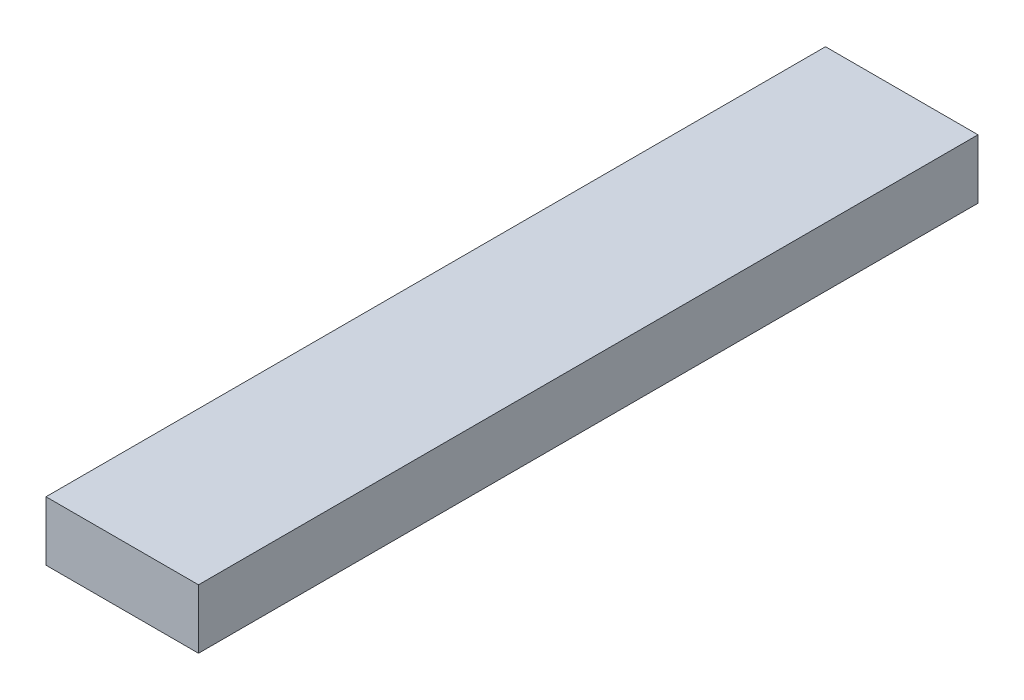
ISO-10303-21;
HEADER;
FILE_DESCRIPTION(('STEP AP214'),'2;1');
FILE_NAME('part.step','',(''),(''),'','','');
FILE_SCHEMA(('AUTOMOTIVE_DESIGN { 1 0 10303 214 1 1 1 1 }'));
ENDSEC;
DATA;
#1=APPLICATION_CONTEXT('core data for automotive mechanical design processes');
#2=APPLICATION_PROTOCOL_DEFINITION('international standard','automotive_design',2000,#1);
#3=PRODUCT_CONTEXT('',#1,'mechanical');
#4=PRODUCT('Part','Part','',(#3));
#5=PRODUCT_RELATED_PRODUCT_CATEGORY('part','',(#4));
#6=PRODUCT_DEFINITION_FORMATION('','',#4);
#7=PRODUCT_DEFINITION_CONTEXT('part definition',#1,'design');
#8=PRODUCT_DEFINITION('design','',#6,#7);
#9=PRODUCT_DEFINITION_SHAPE('','',#8);
#10=(LENGTH_UNIT() NAMED_UNIT(*) SI_UNIT(.MILLI.,.METRE.));
#11=(NAMED_UNIT(*) PLANE_ANGLE_UNIT() SI_UNIT($,.RADIAN.));
#12=(NAMED_UNIT(*) SI_UNIT($,.STERADIAN.) SOLID_ANGLE_UNIT());
#13=UNCERTAINTY_MEASURE_WITH_UNIT(LENGTH_MEASURE(1.E-05),#10,'distance_accuracy_value','');
#14=(GEOMETRIC_REPRESENTATION_CONTEXT(3) GLOBAL_UNCERTAINTY_ASSIGNED_CONTEXT((#13)) GLOBAL_UNIT_ASSIGNED_CONTEXT((#10,
#11,#12)) REPRESENTATION_CONTEXT('',''));
#15=CARTESIAN_POINT('',(0.,0.,0.));
#16=DIRECTION('',(0.,0.,1.));
#17=DIRECTION('',(1.,0.,0.));
#18=AXIS2_PLACEMENT_3D('',#15,#16,#17);
#19=CARTESIAN_POINT('',(-71.5549306416318,5.5177210056772,46.));
#20=DIRECTION('',(1.,0.,0.));
#21=DIRECTION('',(0.,0.,-1.));
#22=AXIS2_PLACEMENT_3D('',#19,#20,#21);
#23=PLANE('',#22);
#24=DIRECTION('',(0.,-1.,0.));
#25=VECTOR('',#24,1.);
#26=CARTESIAN_POINT('',(-71.5549306416318,5.5177210056772,0.));
#27=LINE('',#26,#25);
#28=CARTESIAN_POINT('',(-71.5549306416318,9.0177210056772,0.));
#29=VERTEX_POINT('',#28);
#30=CARTESIAN_POINT('',(-71.5549306416318,5.5177210056772,0.));
#31=VERTEX_POINT('',#30);
#32=EDGE_CURVE('E96',#29,#31,#27,.T.);
#33=ORIENTED_EDGE('',*,*,#32,.T.);
#34=DIRECTION('',(0.,0.,-1.));
#35=VECTOR('',#34,1.);
#36=CARTESIAN_POINT('',(-71.5549306416318,5.5177210056772,46.));
#37=LINE('',#36,#35);
#38=CARTESIAN_POINT('',(-71.5549306416318,5.5177210056772,46.));
#39=VERTEX_POINT('',#38);
#40=EDGE_CURVE('E11',#39,#31,#37,.T.);
#41=ORIENTED_EDGE('',*,*,#40,.F.);
#42=DIRECTION('',(0.,-1.,0.));
#43=VECTOR('',#42,1.);
#44=CARTESIAN_POINT('',(-71.5549306416318,5.5177210056772,46.));
#45=LINE('',#44,#43);
#46=CARTESIAN_POINT('',(-71.5549306416318,9.0177210056772,46.));
#47=VERTEX_POINT('',#46);
#48=EDGE_CURVE('E84',#47,#39,#45,.T.);
#49=ORIENTED_EDGE('',*,*,#48,.F.);
#50=DIRECTION('',(0.,0.,-1.));
#51=VECTOR('',#50,1.);
#52=CARTESIAN_POINT('',(-71.5549306416318,9.0177210056772,46.));
#53=LINE('',#52,#51);
#54=EDGE_CURVE('E92',#47,#29,#53,.T.);
#55=ORIENTED_EDGE('',*,*,#54,.T.);
#56=EDGE_LOOP('',(#33,#41,#49,#55));
#57=FACE_BOUND('',#56,.T.);
#58=ADVANCED_FACE('F33',(#57),#23,.F.);
#59=CARTESIAN_POINT('',(-62.5549306416319,5.5177210056772,46.));
#60=DIRECTION('',(0.,1.,0.));
#61=DIRECTION('',(0.,0.,1.));
#62=AXIS2_PLACEMENT_3D('',#59,#60,#61);
#63=PLANE('',#62);
#64=DIRECTION('',(1.,0.,0.));
#65=VECTOR('',#64,1.);
#66=CARTESIAN_POINT('',(-62.5549306416319,5.5177210056772,0.));
#67=LINE('',#66,#65);
#68=CARTESIAN_POINT('',(-62.5549306416319,5.5177210056772,0.));
#69=VERTEX_POINT('',#68);
#70=EDGE_CURVE('E88',#31,#69,#67,.T.);
#71=ORIENTED_EDGE('',*,*,#70,.T.);
#72=DIRECTION('',(0.,0.,-1.));
#73=VECTOR('',#72,1.);
#74=CARTESIAN_POINT('',(-62.5549306416319,5.5177210056772,46.));
#75=LINE('',#74,#73);
#76=CARTESIAN_POINT('',(-62.5549306416319,5.5177210056772,46.));
#77=VERTEX_POINT('',#76);
#78=EDGE_CURVE('E41',#77,#69,#75,.T.);
#79=ORIENTED_EDGE('',*,*,#78,.F.);
#80=DIRECTION('',(1.,0.,0.));
#81=VECTOR('',#80,1.);
#82=CARTESIAN_POINT('',(-62.5549306416319,5.5177210056772,46.));
#83=LINE('',#82,#81);
#84=EDGE_CURVE('E79',#39,#77,#83,.T.);
#85=ORIENTED_EDGE('',*,*,#84,.F.);
#86=ORIENTED_EDGE('',*,*,#40,.T.);
#87=EDGE_LOOP('',(#71,#79,#85,#86));
#88=FACE_BOUND('',#87,.T.);
#89=ADVANCED_FACE('F87',(#88),#63,.F.);
#90=CARTESIAN_POINT('',(-62.5549306416319,9.0177210056772,46.));
#91=DIRECTION('',(-1.,0.,0.));
#92=DIRECTION('',(0.,0.,1.));
#93=AXIS2_PLACEMENT_3D('',#90,#91,#92);
#94=PLANE('',#93);
#95=DIRECTION('',(0.,1.,0.));
#96=VECTOR('',#95,1.);
#97=CARTESIAN_POINT('',(-62.5549306416319,9.0177210056772,0.));
#98=LINE('',#97,#96);
#99=CARTESIAN_POINT('',(-62.5549306416319,9.0177210056772,0.));
#100=VERTEX_POINT('',#99);
#101=EDGE_CURVE('E66',#69,#100,#98,.T.);
#102=ORIENTED_EDGE('',*,*,#101,.T.);
#103=DIRECTION('',(0.,0.,-1.));
#104=VECTOR('',#103,1.);
#105=CARTESIAN_POINT('',(-62.5549306416319,9.0177210056772,46.));
#106=LINE('',#105,#104);
#107=CARTESIAN_POINT('',(-62.5549306416319,9.0177210056772,46.));
#108=VERTEX_POINT('',#107);
#109=EDGE_CURVE('E89',#108,#100,#106,.T.);
#110=ORIENTED_EDGE('',*,*,#109,.F.);
#111=DIRECTION('',(0.,1.,0.));
#112=VECTOR('',#111,1.);
#113=CARTESIAN_POINT('',(-62.5549306416319,9.0177210056772,46.));
#114=LINE('',#113,#112);
#115=EDGE_CURVE('E82',#77,#108,#114,.T.);
#116=ORIENTED_EDGE('',*,*,#115,.F.);
#117=ORIENTED_EDGE('',*,*,#78,.T.);
#118=EDGE_LOOP('',(#102,#110,#116,#117));
#119=FACE_BOUND('',#118,.T.);
#120=ADVANCED_FACE('F90',(#119),#94,.F.);
#121=CARTESIAN_POINT('',(-71.5549306416318,9.0177210056772,46.));
#122=DIRECTION('',(0.,-1.,0.));
#123=DIRECTION('',(0.,0.,-1.));
#124=AXIS2_PLACEMENT_3D('',#121,#122,#123);
#125=PLANE('',#124);
#126=DIRECTION('',(-1.,0.,0.));
#127=VECTOR('',#126,1.);
#128=CARTESIAN_POINT('',(-71.5549306416318,9.0177210056772,0.));
#129=LINE('',#128,#127);
#130=EDGE_CURVE('E72',#100,#29,#129,.T.);
#131=ORIENTED_EDGE('',*,*,#130,.T.);
#132=ORIENTED_EDGE('',*,*,#54,.F.);
#133=DIRECTION('',(-1.,0.,0.));
#134=VECTOR('',#133,1.);
#135=CARTESIAN_POINT('',(-71.5549306416318,9.0177210056772,46.));
#136=LINE('',#135,#134);
#137=EDGE_CURVE('E49',#108,#47,#136,.T.);
#138=ORIENTED_EDGE('',*,*,#137,.F.);
#139=ORIENTED_EDGE('',*,*,#109,.T.);
#140=EDGE_LOOP('',(#131,#132,#138,#139));
#141=FACE_BOUND('',#140,.T.);
#142=ADVANCED_FACE('F103',(#141),#125,.F.);
#143=CARTESIAN_POINT('',(0.,0.,46.));
#144=DIRECTION('',(0.,0.,-1.));
#145=DIRECTION('',(-1.,0.,0.));
#146=AXIS2_PLACEMENT_3D('',#143,#144,#145);
#147=PLANE('',#146);
#148=ORIENTED_EDGE('',*,*,#48,.T.);
#149=ORIENTED_EDGE('',*,*,#84,.T.);
#150=ORIENTED_EDGE('',*,*,#115,.T.);
#151=ORIENTED_EDGE('',*,*,#137,.T.);
#152=EDGE_LOOP('',(#148,#149,#150,#151));
#153=FACE_BOUND('',#152,.T.);
#154=ADVANCED_FACE('F80',(#153),#147,.F.);
#155=CARTESIAN_POINT('',(0.,0.,0.));
#156=DIRECTION('',(0.,0.,-1.));
#157=DIRECTION('',(-1.,0.,0.));
#158=AXIS2_PLACEMENT_3D('',#155,#156,#157);
#159=PLANE('',#158);
#160=ORIENTED_EDGE('',*,*,#32,.F.);
#161=ORIENTED_EDGE('',*,*,#130,.F.);
#162=ORIENTED_EDGE('',*,*,#101,.F.);
#163=ORIENTED_EDGE('',*,*,#70,.F.);
#164=EDGE_LOOP('',(#160,#161,#162,#163));
#165=FACE_BOUND('',#164,.T.);
#166=ADVANCED_FACE('F106',(#165),#159,.T.);
#167=CLOSED_SHELL('',(#58,#89,#120,#142,#154,#166));
#168=MANIFOLD_SOLID_BREP('B2',#167);
#169=ADVANCED_BREP_SHAPE_REPRESENTATION('',(#18,#168),#14);
#170=SHAPE_DEFINITION_REPRESENTATION(#9,#169);
ENDSEC;
END-ISO-10303-21;
